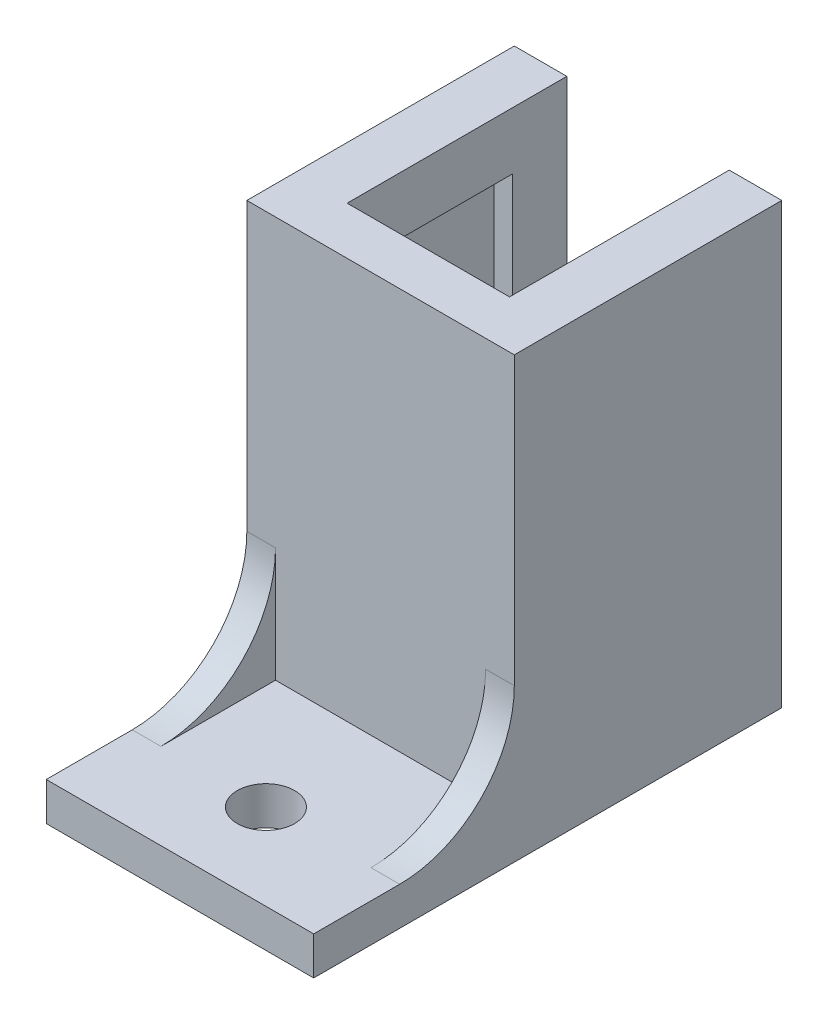
ISO-10303-21;
HEADER;
FILE_DESCRIPTION(('STEP AP214'),'2;1');
FILE_NAME('part.step','',(''),(''),'','','');
FILE_SCHEMA(('AUTOMOTIVE_DESIGN { 1 0 10303 214 1 1 1 1 }'));
ENDSEC;
DATA;
#1=APPLICATION_CONTEXT('core data for automotive mechanical design processes');
#2=APPLICATION_PROTOCOL_DEFINITION('international standard','automotive_design',2000,#1);
#3=PRODUCT_CONTEXT('',#1,'mechanical');
#4=PRODUCT('Part','Part','',(#3));
#5=PRODUCT_RELATED_PRODUCT_CATEGORY('part','',(#4));
#6=PRODUCT_DEFINITION_FORMATION('','',#4);
#7=PRODUCT_DEFINITION_CONTEXT('part definition',#1,'design');
#8=PRODUCT_DEFINITION('design','',#6,#7);
#9=PRODUCT_DEFINITION_SHAPE('','',#8);
#10=(LENGTH_UNIT() NAMED_UNIT(*) SI_UNIT(.MILLI.,.METRE.));
#11=(NAMED_UNIT(*) PLANE_ANGLE_UNIT() SI_UNIT($,.RADIAN.));
#12=(NAMED_UNIT(*) SI_UNIT($,.STERADIAN.) SOLID_ANGLE_UNIT());
#13=UNCERTAINTY_MEASURE_WITH_UNIT(LENGTH_MEASURE(1.E-05),#10,'distance_accuracy_value','');
#14=(GEOMETRIC_REPRESENTATION_CONTEXT(3) GLOBAL_UNCERTAINTY_ASSIGNED_CONTEXT((#13)) GLOBAL_UNIT_ASSIGNED_CONTEXT((#10,
#11,#12)) REPRESENTATION_CONTEXT('',''));
#15=CARTESIAN_POINT('',(0.,0.,0.));
#16=DIRECTION('',(0.,0.,1.));
#17=DIRECTION('',(1.,0.,0.));
#18=AXIS2_PLACEMENT_3D('',#15,#16,#17);
#19=CARTESIAN_POINT('',(0.,0.,0.));
#20=DIRECTION('',(0.,0.,1.));
#21=DIRECTION('',(1.,0.,0.));
#22=AXIS2_PLACEMENT_3D('',#19,#20,#21);
#23=PLANE('',#22);
#24=DIRECTION('',(0.,-1.,0.));
#25=VECTOR('',#24,1.);
#26=CARTESIAN_POINT('',(4.25,8.5,0.));
#27=LINE('',#26,#25);
#28=CARTESIAN_POINT('',(4.25,11.5,0.));
#29=VERTEX_POINT('',#28);
#30=CARTESIAN_POINT('',(4.25,-11.5,0.));
#31=VERTEX_POINT('',#30);
#32=EDGE_CURVE('E293',#29,#31,#27,.T.);
#33=ORIENTED_EDGE('',*,*,#32,.F.);
#34=DIRECTION('',(-1.,0.,0.));
#35=VECTOR('',#34,1.);
#36=CARTESIAN_POINT('',(0.,11.5,0.));
#37=LINE('',#36,#35);
#38=CARTESIAN_POINT('',(7.,11.5,0.));
#39=VERTEX_POINT('',#38);
#40=EDGE_CURVE('E192',#39,#29,#37,.T.);
#41=ORIENTED_EDGE('',*,*,#40,.F.);
#42=DIRECTION('',(0.,-1.,0.));
#43=VECTOR('',#42,1.);
#44=CARTESIAN_POINT('',(7.,0.,0.));
#45=LINE('',#44,#43);
#46=CARTESIAN_POINT('',(7.,-11.5,0.));
#47=VERTEX_POINT('',#46);
#48=EDGE_CURVE('E305',#39,#47,#45,.T.);
#49=ORIENTED_EDGE('',*,*,#48,.T.);
#50=DIRECTION('',(-1.,0.,0.));
#51=VECTOR('',#50,1.);
#52=CARTESIAN_POINT('',(0.,-11.5,0.));
#53=LINE('',#52,#51);
#54=EDGE_CURVE('E316',#47,#31,#53,.T.);
#55=ORIENTED_EDGE('',*,*,#54,.T.);
#56=EDGE_LOOP('',(#33,#41,#49,#55));
#57=FACE_BOUND('',#56,.T.);
#58=ADVANCED_FACE('F36',(#57),#23,.F.);
#59=CARTESIAN_POINT('',(0.,8.5,0.));
#60=DIRECTION('',(0.,-1.,0.));
#61=DIRECTION('',(1.,0.,0.));
#62=AXIS2_PLACEMENT_3D('',#59,#60,#61);
#63=PLANE('',#62);
#64=DIRECTION('',(0.,0.,1.));
#65=VECTOR('',#64,1.);
#66=CARTESIAN_POINT('',(4.25,8.5,0.));
#67=LINE('',#66,#65);
#68=CARTESIAN_POINT('',(4.25,8.5,2.85));
#69=VERTEX_POINT('',#68);
#70=CARTESIAN_POINT('',(4.25,8.5,11.5));
#71=VERTEX_POINT('',#70);
#72=EDGE_CURVE('E11',#69,#71,#67,.T.);
#73=ORIENTED_EDGE('',*,*,#72,.F.);
#74=DIRECTION('',(-1.,0.,0.));
#75=VECTOR('',#74,1.);
#76=CARTESIAN_POINT('',(0.,8.5,2.85));
#77=LINE('',#76,#75);
#78=CARTESIAN_POINT('',(5.2,8.5,2.85));
#79=VERTEX_POINT('',#78);
#80=EDGE_CURVE('E261',#79,#69,#77,.T.);
#81=ORIENTED_EDGE('',*,*,#80,.F.);
#82=DIRECTION('',(0.,0.,1.));
#83=VECTOR('',#82,1.);
#84=CARTESIAN_POINT('',(5.2,8.5,0.));
#85=LINE('',#84,#83);
#86=CARTESIAN_POINT('',(5.2,8.5,11.5));
#87=VERTEX_POINT('',#86);
#88=EDGE_CURVE('E262',#79,#87,#85,.T.);
#89=ORIENTED_EDGE('',*,*,#88,.T.);
#90=DIRECTION('',(-1.,0.,0.));
#91=VECTOR('',#90,1.);
#92=CARTESIAN_POINT('',(0.,8.5,11.5));
#93=LINE('',#92,#91);
#94=EDGE_CURVE('E266',#87,#71,#93,.T.);
#95=ORIENTED_EDGE('',*,*,#94,.T.);
#96=EDGE_LOOP('',(#73,#81,#89,#95));
#97=FACE_BOUND('',#96,.T.);
#98=ADVANCED_FACE('F371',(#97),#63,.T.);
#99=CARTESIAN_POINT('',(0.,0.,14.));
#100=DIRECTION('',(0.,0.,1.));
#101=DIRECTION('',(1.,0.,0.));
#102=AXIS2_PLACEMENT_3D('',#99,#100,#101);
#103=PLANE('',#102);
#104=DIRECTION('',(0.,-1.,0.));
#105=VECTOR('',#104,1.);
#106=CARTESIAN_POINT('',(5.5,-3.5,14.));
#107=LINE('',#106,#105);
#108=CARTESIAN_POINT('',(5.5,-3.5,14.));
#109=VERTEX_POINT('',#108);
#110=CARTESIAN_POINT('',(5.5,-9.5,14.));
#111=VERTEX_POINT('',#110);
#112=EDGE_CURVE('E203',#109,#111,#107,.T.);
#113=ORIENTED_EDGE('',*,*,#112,.F.);
#114=DIRECTION('',(1.,0.,0.));
#115=VECTOR('',#114,1.);
#116=CARTESIAN_POINT('',(5.5,-3.5,14.));
#117=LINE('',#116,#115);
#118=CARTESIAN_POINT('',(7.,-3.5,14.));
#119=VERTEX_POINT('',#118);
#120=EDGE_CURVE('E207',#109,#119,#117,.T.);
#121=ORIENTED_EDGE('',*,*,#120,.T.);
#122=DIRECTION('',(0.,-1.,0.));
#123=VECTOR('',#122,1.);
#124=CARTESIAN_POINT('',(7.,0.,14.));
#125=LINE('',#124,#123);
#126=CARTESIAN_POINT('',(7.,11.5,14.));
#127=VERTEX_POINT('',#126);
#128=EDGE_CURVE('E308',#127,#119,#125,.T.);
#129=ORIENTED_EDGE('',*,*,#128,.F.);
#130=DIRECTION('',(-1.,0.,0.));
#131=VECTOR('',#130,1.);
#132=CARTESIAN_POINT('',(0.,11.5,14.));
#133=LINE('',#132,#131);
#134=CARTESIAN_POINT('',(-7.,11.5,14.));
#135=VERTEX_POINT('',#134);
#136=EDGE_CURVE('E301',#127,#135,#133,.T.);
#137=ORIENTED_EDGE('',*,*,#136,.T.);
#138=DIRECTION('',(0.,-1.,0.));
#139=VECTOR('',#138,1.);
#140=CARTESIAN_POINT('',(-7.,0.,14.));
#141=LINE('',#140,#139);
#142=CARTESIAN_POINT('',(-7.,-3.5,14.));
#143=VERTEX_POINT('',#142);
#144=EDGE_CURVE('E304',#135,#143,#141,.T.);
#145=ORIENTED_EDGE('',*,*,#144,.T.);
#146=DIRECTION('',(-1.,0.,0.));
#147=VECTOR('',#146,1.);
#148=CARTESIAN_POINT('',(-5.5,-3.5,14.));
#149=LINE('',#148,#147);
#150=CARTESIAN_POINT('',(-5.5,-3.5,14.));
#151=VERTEX_POINT('',#150);
#152=EDGE_CURVE('E221',#151,#143,#149,.T.);
#153=ORIENTED_EDGE('',*,*,#152,.F.);
#154=DIRECTION('',(0.,-1.,0.));
#155=VECTOR('',#154,1.);
#156=CARTESIAN_POINT('',(-5.5,-3.5,14.));
#157=LINE('',#156,#155);
#158=CARTESIAN_POINT('',(-5.5,-9.5,14.));
#159=VERTEX_POINT('',#158);
#160=EDGE_CURVE('E215',#151,#159,#157,.T.);
#161=ORIENTED_EDGE('',*,*,#160,.T.);
#162=DIRECTION('',(1.,0.,0.));
#163=VECTOR('',#162,1.);
#164=CARTESIAN_POINT('',(7.,-9.5,14.));
#165=LINE('',#164,#163);
#166=EDGE_CURVE('E243',#159,#111,#165,.T.);
#167=ORIENTED_EDGE('',*,*,#166,.T.);
#168=EDGE_LOOP('',(#113,#121,#129,#137,#145,#153,#161,#167));
#169=FACE_BOUND('',#168,.T.);
#170=ADVANCED_FACE('F356',(#169),#103,.T.);
#171=CARTESIAN_POINT('',(0.,-9.5,0.));
#172=DIRECTION('',(0.,-1.,0.));
#173=DIRECTION('',(1.,0.,0.));
#174=AXIS2_PLACEMENT_3D('',#171,#172,#173);
#175=PLANE('',#174);
#176=CARTESIAN_POINT('',(0.,-9.5,20.));
#177=DIRECTION('',(0.,-1.,0.));
#178=DIRECTION('',(1.,0.,0.));
#179=AXIS2_PLACEMENT_3D('',#176,#177,#178);
#180=CIRCLE('',#179,1.5);
#181=CARTESIAN_POINT('',(1.5,-9.5,20.));
#182=VERTEX_POINT('',#181);
#183=EDGE_CURVE('E229',#182,#182,#180,.T.);
#184=ORIENTED_EDGE('',*,*,#183,.T.);
#185=EDGE_LOOP('',(#184));
#186=FACE_BOUND('',#185,.T.);
#187=DIRECTION('',(1.,0.,0.));
#188=VECTOR('',#187,1.);
#189=CARTESIAN_POINT('',(5.5,-9.5,20.));
#190=LINE('',#189,#188);
#191=CARTESIAN_POINT('',(5.5,-9.5,20.));
#192=VERTEX_POINT('',#191);
#193=CARTESIAN_POINT('',(7.,-9.5,20.));
#194=VERTEX_POINT('',#193);
#195=EDGE_CURVE('E205',#192,#194,#190,.T.);
#196=ORIENTED_EDGE('',*,*,#195,.F.);
#197=DIRECTION('',(0.,0.,1.));
#198=VECTOR('',#197,1.);
#199=CARTESIAN_POINT('',(5.5,-9.5,14.));
#200=LINE('',#199,#198);
#201=EDGE_CURVE('E201',#111,#192,#200,.T.);
#202=ORIENTED_EDGE('',*,*,#201,.F.);
#203=ORIENTED_EDGE('',*,*,#166,.F.);
#204=DIRECTION('',(0.,0.,1.));
#205=VECTOR('',#204,1.);
#206=CARTESIAN_POINT('',(-5.5,-9.5,14.));
#207=LINE('',#206,#205);
#208=CARTESIAN_POINT('',(-5.5,-9.5,20.));
#209=VERTEX_POINT('',#208);
#210=EDGE_CURVE('E218',#159,#209,#207,.T.);
#211=ORIENTED_EDGE('',*,*,#210,.T.);
#212=DIRECTION('',(-1.,0.,0.));
#213=VECTOR('',#212,1.);
#214=CARTESIAN_POINT('',(-5.5,-9.5,20.));
#215=LINE('',#214,#213);
#216=CARTESIAN_POINT('',(-7.,-9.5,20.));
#217=VERTEX_POINT('',#216);
#218=EDGE_CURVE('E224',#209,#217,#215,.T.);
#219=ORIENTED_EDGE('',*,*,#218,.T.);
#220=DIRECTION('',(0.,0.,-1.));
#221=VECTOR('',#220,1.);
#222=CARTESIAN_POINT('',(-7.,-9.5,14.));
#223=LINE('',#222,#221);
#224=CARTESIAN_POINT('',(-7.,-9.5,24.5));
#225=VERTEX_POINT('',#224);
#226=EDGE_CURVE('E240',#225,#217,#223,.T.);
#227=ORIENTED_EDGE('',*,*,#226,.F.);
#228=DIRECTION('',(-1.,0.,0.));
#229=VECTOR('',#228,1.);
#230=CARTESIAN_POINT('',(7.,-9.5,24.5));
#231=LINE('',#230,#229);
#232=CARTESIAN_POINT('',(7.,-9.5,24.5));
#233=VERTEX_POINT('',#232);
#234=EDGE_CURVE('E237',#233,#225,#231,.T.);
#235=ORIENTED_EDGE('',*,*,#234,.F.);
#236=DIRECTION('',(0.,0.,1.));
#237=VECTOR('',#236,1.);
#238=CARTESIAN_POINT('',(7.,-9.5,14.));
#239=LINE('',#238,#237);
#240=EDGE_CURVE('E235',#194,#233,#239,.T.);
#241=ORIENTED_EDGE('',*,*,#240,.F.);
#242=EDGE_LOOP('',(#196,#202,#203,#211,#219,#227,#235,#241));
#243=FACE_BOUND('',#242,.T.);
#244=ADVANCED_FACE('F351',(#186,#243),#175,.F.);
#245=CARTESIAN_POINT('',(0.,-11.5,14.));
#246=DIRECTION('',(0.,-1.,0.));
#247=DIRECTION('',(1.,0.,0.));
#248=AXIS2_PLACEMENT_3D('',#245,#246,#247);
#249=PLANE('',#248);
#250=DIRECTION('',(-1.,0.,0.));
#251=VECTOR('',#250,1.);
#252=CARTESIAN_POINT('',(0.,-11.5,2.85));
#253=LINE('',#252,#251);
#254=CARTESIAN_POINT('',(5.2,-11.5,2.85));
#255=VERTEX_POINT('',#254);
#256=CARTESIAN_POINT('',(4.25,-11.5,2.85));
#257=VERTEX_POINT('',#256);
#258=EDGE_CURVE('E275',#255,#257,#253,.T.);
#259=ORIENTED_EDGE('',*,*,#258,.T.);
#260=DIRECTION('',(0.,0.,-1.));
#261=VECTOR('',#260,1.);
#262=CARTESIAN_POINT('',(4.25,-11.5,0.));
#263=LINE('',#262,#261);
#264=EDGE_CURVE('E277',#257,#31,#263,.T.);
#265=ORIENTED_EDGE('',*,*,#264,.T.);
#266=ORIENTED_EDGE('',*,*,#54,.F.);
#267=DIRECTION('',(0.,0.,-1.));
#268=VECTOR('',#267,1.);
#269=CARTESIAN_POINT('',(7.,-11.5,14.));
#270=LINE('',#269,#268);
#271=CARTESIAN_POINT('',(7.,-11.5,24.5));
#272=VERTEX_POINT('',#271);
#273=EDGE_CURVE('E322',#272,#47,#270,.T.);
#274=ORIENTED_EDGE('',*,*,#273,.F.);
#275=DIRECTION('',(-1.,0.,0.));
#276=VECTOR('',#275,1.);
#277=CARTESIAN_POINT('',(7.,-11.5,24.5));
#278=LINE('',#277,#276);
#279=CARTESIAN_POINT('',(-7.,-11.5,24.5));
#280=VERTEX_POINT('',#279);
#281=EDGE_CURVE('E232',#272,#280,#278,.T.);
#282=ORIENTED_EDGE('',*,*,#281,.T.);
#283=DIRECTION('',(0.,0.,-1.));
#284=VECTOR('',#283,1.);
#285=CARTESIAN_POINT('',(-7.,-11.5,14.));
#286=LINE('',#285,#284);
#287=CARTESIAN_POINT('',(-7.,-11.5,0.));
#288=VERTEX_POINT('',#287);
#289=EDGE_CURVE('E324',#280,#288,#286,.T.);
#290=ORIENTED_EDGE('',*,*,#289,.T.);
#291=CARTESIAN_POINT('',(-4.25,-11.5,0.));
#292=VERTEX_POINT('',#291);
#293=EDGE_CURVE('E315',#292,#288,#53,.T.);
#294=ORIENTED_EDGE('',*,*,#293,.F.);
#295=DIRECTION('',(0.,0.,-1.));
#296=VECTOR('',#295,1.);
#297=CARTESIAN_POINT('',(-4.25,-11.5,0.));
#298=LINE('',#297,#296);
#299=CARTESIAN_POINT('',(-4.25,-11.5,2.85));
#300=VERTEX_POINT('',#299);
#301=EDGE_CURVE('E274',#300,#292,#298,.T.);
#302=ORIENTED_EDGE('',*,*,#301,.F.);
#303=CARTESIAN_POINT('',(-5.2,-11.5,2.85));
#304=VERTEX_POINT('',#303);
#305=EDGE_CURVE('E271',#300,#304,#253,.T.);
#306=ORIENTED_EDGE('',*,*,#305,.T.);
#307=DIRECTION('',(0.,0.,1.));
#308=VECTOR('',#307,1.);
#309=CARTESIAN_POINT('',(-5.2,-11.5,0.));
#310=LINE('',#309,#308);
#311=CARTESIAN_POINT('',(-5.2,-11.5,11.5));
#312=VERTEX_POINT('',#311);
#313=EDGE_CURVE('E252',#304,#312,#310,.T.);
#314=ORIENTED_EDGE('',*,*,#313,.T.);
#315=DIRECTION('',(-1.,0.,0.));
#316=VECTOR('',#315,1.);
#317=CARTESIAN_POINT('',(0.,-11.5,11.5));
#318=LINE('',#317,#316);
#319=CARTESIAN_POINT('',(5.2,-11.5,11.5));
#320=VERTEX_POINT('',#319);
#321=EDGE_CURVE('E259',#320,#312,#318,.T.);
#322=ORIENTED_EDGE('',*,*,#321,.F.);
#323=DIRECTION('',(0.,0.,1.));
#324=VECTOR('',#323,1.);
#325=CARTESIAN_POINT('',(5.2,-11.5,0.));
#326=LINE('',#325,#324);
#327=EDGE_CURVE('E280',#255,#320,#326,.T.);
#328=ORIENTED_EDGE('',*,*,#327,.F.);
#329=EDGE_LOOP('',(#259,#265,#266,#274,#282,#290,#294,#302,#306,#314,#322,#328));
#330=FACE_BOUND('',#329,.T.);
#331=CARTESIAN_POINT('',(0.,-11.5,20.));
#332=DIRECTION('',(0.,-1.,0.));
#333=DIRECTION('',(1.,0.,0.));
#334=AXIS2_PLACEMENT_3D('',#331,#332,#333);
#335=CIRCLE('',#334,1.5);
#336=CARTESIAN_POINT('',(1.5,-11.5,20.));
#337=VERTEX_POINT('',#336);
#338=EDGE_CURVE('E227',#337,#337,#335,.T.);
#339=ORIENTED_EDGE('',*,*,#338,.F.);
#340=EDGE_LOOP('',(#339));
#341=FACE_BOUND('',#340,.T.);
#342=ADVANCED_FACE('F340',(#330,#341),#249,.T.);
#343=CARTESIAN_POINT('',(-4.25,11.5,0.));
#344=VERTEX_POINT('',#343);
#345=CARTESIAN_POINT('',(-7.,11.5,0.));
#346=VERTEX_POINT('',#345);
#347=EDGE_CURVE('E286',#344,#346,#37,.T.);
#348=ORIENTED_EDGE('',*,*,#347,.F.);
#349=DIRECTION('',(0.,-1.,0.));
#350=VECTOR('',#349,1.);
#351=CARTESIAN_POINT('',(-4.25,8.5,0.));
#352=LINE('',#351,#350);
#353=EDGE_CURVE('E295',#344,#292,#352,.T.);
#354=ORIENTED_EDGE('',*,*,#353,.T.);
#355=ORIENTED_EDGE('',*,*,#293,.T.);
#356=DIRECTION('',(0.,-1.,0.));
#357=VECTOR('',#356,1.);
#358=CARTESIAN_POINT('',(-7.,0.,0.));
#359=LINE('',#358,#357);
#360=EDGE_CURVE('E312',#346,#288,#359,.T.);
#361=ORIENTED_EDGE('',*,*,#360,.F.);
#362=EDGE_LOOP('',(#348,#354,#355,#361));
#363=FACE_BOUND('',#362,.T.);
#364=ADVANCED_FACE('F335',(#363),#23,.F.);
#365=CARTESIAN_POINT('',(0.,11.5,14.));
#366=DIRECTION('',(0.,-1.,0.));
#367=DIRECTION('',(1.,0.,0.));
#368=AXIS2_PLACEMENT_3D('',#365,#366,#367);
#369=PLANE('',#368);
#370=ORIENTED_EDGE('',*,*,#40,.T.);
#371=DIRECTION('',(0.,0.,1.));
#372=VECTOR('',#371,1.);
#373=CARTESIAN_POINT('',(4.25,11.5,0.));
#374=LINE('',#373,#372);
#375=CARTESIAN_POINT('',(4.25,11.5,11.5));
#376=VERTEX_POINT('',#375);
#377=EDGE_CURVE('E175',#29,#376,#374,.T.);
#378=ORIENTED_EDGE('',*,*,#377,.T.);
#379=DIRECTION('',(-1.,0.,0.));
#380=VECTOR('',#379,1.);
#381=CARTESIAN_POINT('',(4.25,11.5,11.5));
#382=LINE('',#381,#380);
#383=CARTESIAN_POINT('',(-4.25,11.5,11.5));
#384=VERTEX_POINT('',#383);
#385=EDGE_CURVE('E183',#376,#384,#382,.T.);
#386=ORIENTED_EDGE('',*,*,#385,.T.);
#387=DIRECTION('',(0.,0.,-1.));
#388=VECTOR('',#387,1.);
#389=CARTESIAN_POINT('',(-4.25,11.5,0.));
#390=LINE('',#389,#388);
#391=EDGE_CURVE('E180',#384,#344,#390,.T.);
#392=ORIENTED_EDGE('',*,*,#391,.T.);
#393=ORIENTED_EDGE('',*,*,#347,.T.);
#394=DIRECTION('',(0.,0.,-1.));
#395=VECTOR('',#394,1.);
#396=CARTESIAN_POINT('',(-7.,11.5,14.));
#397=LINE('',#396,#395);
#398=EDGE_CURVE('E44',#135,#346,#397,.T.);
#399=ORIENTED_EDGE('',*,*,#398,.F.);
#400=ORIENTED_EDGE('',*,*,#136,.F.);
#401=DIRECTION('',(0.,0.,-1.));
#402=VECTOR('',#401,1.);
#403=CARTESIAN_POINT('',(7.,11.5,14.));
#404=LINE('',#403,#402);
#405=EDGE_CURVE('E310',#127,#39,#404,.T.);
#406=ORIENTED_EDGE('',*,*,#405,.T.);
#407=EDGE_LOOP('',(#370,#378,#386,#392,#393,#399,#400,#406));
#408=FACE_BOUND('',#407,.T.);
#409=ADVANCED_FACE('F38',(#408),#369,.F.);
#410=CARTESIAN_POINT('',(-7.,0.,14.));
#411=DIRECTION('',(1.,0.,0.));
#412=DIRECTION('',(0.,1.,0.));
#413=AXIS2_PLACEMENT_3D('',#410,#411,#412);
#414=PLANE('',#413);
#415=ORIENTED_EDGE('',*,*,#360,.T.);
#416=ORIENTED_EDGE('',*,*,#289,.F.);
#417=DIRECTION('',(0.,-1.,0.));
#418=VECTOR('',#417,1.);
#419=CARTESIAN_POINT('',(-7.,-9.5,24.5));
#420=LINE('',#419,#418);
#421=EDGE_CURVE('E249',#225,#280,#420,.T.);
#422=ORIENTED_EDGE('',*,*,#421,.F.);
#423=ORIENTED_EDGE('',*,*,#226,.T.);
#424=CARTESIAN_POINT('',(-7.,-3.5,20.));
#425=DIRECTION('',(1.,0.,0.));
#426=DIRECTION('',(0.,1.,0.));
#427=AXIS2_PLACEMENT_3D('',#424,#425,#426);
#428=CIRCLE('',#427,6.);
#429=EDGE_CURVE('E210',#217,#143,#428,.T.);
#430=ORIENTED_EDGE('',*,*,#429,.T.);
#431=ORIENTED_EDGE('',*,*,#144,.F.);
#432=ORIENTED_EDGE('',*,*,#398,.T.);
#433=EDGE_LOOP('',(#415,#416,#422,#423,#430,#431,#432));
#434=FACE_BOUND('',#433,.T.);
#435=ADVANCED_FACE('F329',(#434),#414,.F.);
#436=CARTESIAN_POINT('',(7.,0.,14.));
#437=DIRECTION('',(1.,0.,0.));
#438=DIRECTION('',(0.,1.,0.));
#439=AXIS2_PLACEMENT_3D('',#436,#437,#438);
#440=PLANE('',#439);
#441=ORIENTED_EDGE('',*,*,#48,.F.);
#442=ORIENTED_EDGE('',*,*,#405,.F.);
#443=ORIENTED_EDGE('',*,*,#128,.T.);
#444=CARTESIAN_POINT('',(7.,-3.5,20.));
#445=DIRECTION('',(1.,0.,0.));
#446=DIRECTION('',(0.,1.,0.));
#447=AXIS2_PLACEMENT_3D('',#444,#445,#446);
#448=CIRCLE('',#447,6.);
#449=EDGE_CURVE('E58',#194,#119,#448,.T.);
#450=ORIENTED_EDGE('',*,*,#449,.F.);
#451=ORIENTED_EDGE('',*,*,#240,.T.);
#452=DIRECTION('',(0.,-1.,0.));
#453=VECTOR('',#452,1.);
#454=CARTESIAN_POINT('',(7.,-9.5,24.5));
#455=LINE('',#454,#453);
#456=EDGE_CURVE('E246',#233,#272,#455,.T.);
#457=ORIENTED_EDGE('',*,*,#456,.T.);
#458=ORIENTED_EDGE('',*,*,#273,.T.);
#459=EDGE_LOOP('',(#441,#442,#443,#450,#451,#457,#458));
#460=FACE_BOUND('',#459,.T.);
#461=ADVANCED_FACE('F359',(#460),#440,.T.);
#462=CARTESIAN_POINT('',(-5.2,8.5,0.));
#463=DIRECTION('',(1.,0.,0.));
#464=DIRECTION('',(0.,1.,0.));
#465=AXIS2_PLACEMENT_3D('',#462,#463,#464);
#466=PLANE('',#465);
#467=ORIENTED_EDGE('',*,*,#313,.F.);
#468=DIRECTION('',(0.,-1.,0.));
#469=VECTOR('',#468,1.);
#470=CARTESIAN_POINT('',(-5.2,8.5,2.85));
#471=LINE('',#470,#469);
#472=CARTESIAN_POINT('',(-5.2,8.5,2.85));
#473=VERTEX_POINT('',#472);
#474=EDGE_CURVE('E268',#473,#304,#471,.T.);
#475=ORIENTED_EDGE('',*,*,#474,.F.);
#476=DIRECTION('',(0.,0.,1.));
#477=VECTOR('',#476,1.);
#478=CARTESIAN_POINT('',(-5.2,8.5,0.));
#479=LINE('',#478,#477);
#480=CARTESIAN_POINT('',(-5.2,8.5,11.5));
#481=VERTEX_POINT('',#480);
#482=EDGE_CURVE('E255',#473,#481,#479,.T.);
#483=ORIENTED_EDGE('',*,*,#482,.T.);
#484=DIRECTION('',(0.,-1.,0.));
#485=VECTOR('',#484,1.);
#486=CARTESIAN_POINT('',(-5.2,8.5,11.5));
#487=LINE('',#486,#485);
#488=EDGE_CURVE('E284',#481,#312,#487,.T.);
#489=ORIENTED_EDGE('',*,*,#488,.T.);
#490=EDGE_LOOP('',(#467,#475,#483,#489));
#491=FACE_BOUND('',#490,.T.);
#492=ADVANCED_FACE('F379',(#491),#466,.T.);
#493=CARTESIAN_POINT('',(0.,8.5,11.5));
#494=DIRECTION('',(0.,0.,1.));
#495=DIRECTION('',(1.,0.,0.));
#496=AXIS2_PLACEMENT_3D('',#493,#494,#495);
#497=PLANE('',#496);
#498=ORIENTED_EDGE('',*,*,#321,.T.);
#499=ORIENTED_EDGE('',*,*,#488,.F.);
#500=CARTESIAN_POINT('',(-4.25,8.5,11.5));
#501=VERTEX_POINT('',#500);
#502=EDGE_CURVE('E265',#501,#481,#93,.T.);
#503=ORIENTED_EDGE('',*,*,#502,.F.);
#504=DIRECTION('',(0.,-1.,0.));
#505=VECTOR('',#504,1.);
#506=CARTESIAN_POINT('',(-4.25,11.5,11.5));
#507=LINE('',#506,#505);
#508=EDGE_CURVE('E179',#384,#501,#507,.T.);
#509=ORIENTED_EDGE('',*,*,#508,.F.);
#510=ORIENTED_EDGE('',*,*,#385,.F.);
#511=DIRECTION('',(0.,-1.,0.));
#512=VECTOR('',#511,1.);
#513=CARTESIAN_POINT('',(4.25,11.5,11.5));
#514=LINE('',#513,#512);
#515=EDGE_CURVE('E51',#376,#71,#514,.T.);
#516=ORIENTED_EDGE('',*,*,#515,.T.);
#517=ORIENTED_EDGE('',*,*,#94,.F.);
#518=DIRECTION('',(0.,-1.,0.));
#519=VECTOR('',#518,1.);
#520=CARTESIAN_POINT('',(5.2,8.5,11.5));
#521=LINE('',#520,#519);
#522=EDGE_CURVE('E287',#87,#320,#521,.T.);
#523=ORIENTED_EDGE('',*,*,#522,.T.);
#524=EDGE_LOOP('',(#498,#499,#503,#509,#510,#516,#517,#523));
#525=FACE_BOUND('',#524,.T.);
#526=ADVANCED_FACE('F185',(#525),#497,.F.);
#527=CARTESIAN_POINT('',(5.2,8.5,0.));
#528=DIRECTION('',(1.,0.,0.));
#529=DIRECTION('',(0.,1.,0.));
#530=AXIS2_PLACEMENT_3D('',#527,#528,#529);
#531=PLANE('',#530);
#532=ORIENTED_EDGE('',*,*,#327,.T.);
#533=ORIENTED_EDGE('',*,*,#522,.F.);
#534=ORIENTED_EDGE('',*,*,#88,.F.);
#535=DIRECTION('',(0.,-1.,0.));
#536=VECTOR('',#535,1.);
#537=CARTESIAN_POINT('',(5.2,8.5,2.85));
#538=LINE('',#537,#536);
#539=EDGE_CURVE('E289',#79,#255,#538,.T.);
#540=ORIENTED_EDGE('',*,*,#539,.T.);
#541=EDGE_LOOP('',(#532,#533,#534,#540));
#542=FACE_BOUND('',#541,.T.);
#543=ADVANCED_FACE('F373',(#542),#531,.F.);
#544=CARTESIAN_POINT('',(0.,8.5,2.85));
#545=DIRECTION('',(0.,0.,1.));
#546=DIRECTION('',(1.,0.,0.));
#547=AXIS2_PLACEMENT_3D('',#544,#545,#546);
#548=PLANE('',#547);
#549=ORIENTED_EDGE('',*,*,#258,.F.);
#550=ORIENTED_EDGE('',*,*,#539,.F.);
#551=ORIENTED_EDGE('',*,*,#80,.T.);
#552=DIRECTION('',(0.,-1.,0.));
#553=VECTOR('',#552,1.);
#554=CARTESIAN_POINT('',(4.25,8.5,2.85));
#555=LINE('',#554,#553);
#556=EDGE_CURVE('E291',#69,#257,#555,.T.);
#557=ORIENTED_EDGE('',*,*,#556,.T.);
#558=EDGE_LOOP('',(#549,#550,#551,#557));
#559=FACE_BOUND('',#558,.T.);
#560=ADVANCED_FACE('F366',(#559),#548,.T.);
#561=CARTESIAN_POINT('',(4.25,8.5,0.));
#562=DIRECTION('',(-1.,0.,0.));
#563=DIRECTION('',(0.,0.,1.));
#564=AXIS2_PLACEMENT_3D('',#561,#562,#563);
#565=PLANE('',#564);
#566=ORIENTED_EDGE('',*,*,#264,.F.);
#567=ORIENTED_EDGE('',*,*,#556,.F.);
#568=ORIENTED_EDGE('',*,*,#72,.T.);
#569=ORIENTED_EDGE('',*,*,#515,.F.);
#570=ORIENTED_EDGE('',*,*,#377,.F.);
#571=ORIENTED_EDGE('',*,*,#32,.T.);
#572=EDGE_LOOP('',(#566,#567,#568,#569,#570,#571));
#573=FACE_BOUND('',#572,.T.);
#574=ADVANCED_FACE('F173',(#573),#565,.T.);
#575=CARTESIAN_POINT('',(-4.25,8.5,0.));
#576=DIRECTION('',(-1.,0.,0.));
#577=DIRECTION('',(0.,0.,1.));
#578=AXIS2_PLACEMENT_3D('',#575,#576,#577);
#579=PLANE('',#578);
#580=ORIENTED_EDGE('',*,*,#301,.T.);
#581=ORIENTED_EDGE('',*,*,#353,.F.);
#582=ORIENTED_EDGE('',*,*,#391,.F.);
#583=ORIENTED_EDGE('',*,*,#508,.T.);
#584=DIRECTION('',(0.,0.,-1.));
#585=VECTOR('',#584,1.);
#586=CARTESIAN_POINT('',(-4.25,8.5,0.));
#587=LINE('',#586,#585);
#588=CARTESIAN_POINT('',(-4.25,8.5,2.85));
#589=VERTEX_POINT('',#588);
#590=EDGE_CURVE('E193',#501,#589,#587,.T.);
#591=ORIENTED_EDGE('',*,*,#590,.T.);
#592=DIRECTION('',(0.,-1.,0.));
#593=VECTOR('',#592,1.);
#594=CARTESIAN_POINT('',(-4.25,8.5,2.85));
#595=LINE('',#594,#593);
#596=EDGE_CURVE('E298',#589,#300,#595,.T.);
#597=ORIENTED_EDGE('',*,*,#596,.T.);
#598=EDGE_LOOP('',(#580,#581,#582,#583,#591,#597));
#599=FACE_BOUND('',#598,.T.);
#600=ADVANCED_FACE('F387',(#599),#579,.F.);
#601=ORIENTED_EDGE('',*,*,#305,.F.);
#602=ORIENTED_EDGE('',*,*,#596,.F.);
#603=EDGE_CURVE('E258',#589,#473,#77,.T.);
#604=ORIENTED_EDGE('',*,*,#603,.T.);
#605=ORIENTED_EDGE('',*,*,#474,.T.);
#606=EDGE_LOOP('',(#601,#602,#604,#605));
#607=FACE_BOUND('',#606,.T.);
#608=ADVANCED_FACE('F389',(#607),#548,.T.);
#609=ORIENTED_EDGE('',*,*,#590,.F.);
#610=ORIENTED_EDGE('',*,*,#502,.T.);
#611=ORIENTED_EDGE('',*,*,#482,.F.);
#612=ORIENTED_EDGE('',*,*,#603,.F.);
#613=EDGE_LOOP('',(#609,#610,#611,#612));
#614=FACE_BOUND('',#613,.T.);
#615=ADVANCED_FACE('F384',(#614),#63,.T.);
#616=CARTESIAN_POINT('',(7.,-9.5,24.5));
#617=DIRECTION('',(0.,0.,1.));
#618=DIRECTION('',(1.,0.,0.));
#619=AXIS2_PLACEMENT_3D('',#616,#617,#618);
#620=PLANE('',#619);
#621=ORIENTED_EDGE('',*,*,#281,.F.);
#622=ORIENTED_EDGE('',*,*,#456,.F.);
#623=ORIENTED_EDGE('',*,*,#234,.T.);
#624=ORIENTED_EDGE('',*,*,#421,.T.);
#625=EDGE_LOOP('',(#621,#622,#623,#624));
#626=FACE_BOUND('',#625,.T.);
#627=ADVANCED_FACE('F345',(#626),#620,.T.);
#628=CARTESIAN_POINT('',(0.,-9.5,20.));
#629=DIRECTION('',(0.,-1.,0.));
#630=DIRECTION('',(1.,0.,0.));
#631=AXIS2_PLACEMENT_3D('',#628,#629,#630);
#632=CYLINDRICAL_SURFACE('',#631,1.5);
#633=ORIENTED_EDGE('',*,*,#183,.F.);
#634=EDGE_LOOP('',(#633));
#635=FACE_BOUND('',#634,.T.);
#636=ORIENTED_EDGE('',*,*,#338,.T.);
#637=EDGE_LOOP('',(#636));
#638=FACE_BOUND('',#637,.T.);
#639=ADVANCED_FACE('F542',(#635,#638),#632,.F.);
#640=CARTESIAN_POINT('',(-5.5,-3.5,20.));
#641=DIRECTION('',(-1.,0.,0.));
#642=DIRECTION('',(0.,-1.,0.));
#643=AXIS2_PLACEMENT_3D('',#640,#641,#642);
#644=CYLINDRICAL_SURFACE('',#643,6.);
#645=ORIENTED_EDGE('',*,*,#429,.F.);
#646=ORIENTED_EDGE('',*,*,#218,.F.);
#647=CARTESIAN_POINT('',(-5.5,-3.5,20.));
#648=DIRECTION('',(1.,0.,0.));
#649=DIRECTION('',(0.,1.,0.));
#650=AXIS2_PLACEMENT_3D('',#647,#648,#649);
#651=CIRCLE('',#650,6.);
#652=EDGE_CURVE('E212',#209,#151,#651,.T.);
#653=ORIENTED_EDGE('',*,*,#652,.T.);
#654=ORIENTED_EDGE('',*,*,#152,.T.);
#655=EDGE_LOOP('',(#645,#646,#653,#654));
#656=FACE_BOUND('',#655,.T.);
#657=ADVANCED_FACE('F549',(#656),#644,.F.);
#658=CARTESIAN_POINT('',(-5.5,-3.5,20.));
#659=DIRECTION('',(1.,0.,0.));
#660=DIRECTION('',(0.,1.,0.));
#661=AXIS2_PLACEMENT_3D('',#658,#659,#660);
#662=PLANE('',#661);
#663=ORIENTED_EDGE('',*,*,#652,.F.);
#664=ORIENTED_EDGE('',*,*,#210,.F.);
#665=ORIENTED_EDGE('',*,*,#160,.F.);
#666=EDGE_LOOP('',(#663,#664,#665));
#667=FACE_BOUND('',#666,.T.);
#668=ADVANCED_FACE('F458',(#667),#662,.T.);
#669=CARTESIAN_POINT('',(5.5,-3.5,20.));
#670=DIRECTION('',(1.,0.,0.));
#671=DIRECTION('',(0.,1.,0.));
#672=AXIS2_PLACEMENT_3D('',#669,#670,#671);
#673=CYLINDRICAL_SURFACE('',#672,6.);
#674=ORIENTED_EDGE('',*,*,#449,.T.);
#675=ORIENTED_EDGE('',*,*,#120,.F.);
#676=CARTESIAN_POINT('',(5.5,-3.5,20.));
#677=DIRECTION('',(1.,0.,0.));
#678=DIRECTION('',(0.,1.,0.));
#679=AXIS2_PLACEMENT_3D('',#676,#677,#678);
#680=CIRCLE('',#679,6.);
#681=EDGE_CURVE('E199',#192,#109,#680,.T.);
#682=ORIENTED_EDGE('',*,*,#681,.F.);
#683=ORIENTED_EDGE('',*,*,#195,.T.);
#684=EDGE_LOOP('',(#674,#675,#682,#683));
#685=FACE_BOUND('',#684,.T.);
#686=ADVANCED_FACE('F453',(#685),#673,.F.);
#687=CARTESIAN_POINT('',(5.5,-3.5,20.));
#688=DIRECTION('',(-1.,0.,0.));
#689=DIRECTION('',(0.,1.,0.));
#690=AXIS2_PLACEMENT_3D('',#687,#688,#689);
#691=PLANE('',#690);
#692=ORIENTED_EDGE('',*,*,#681,.T.);
#693=ORIENTED_EDGE('',*,*,#112,.T.);
#694=ORIENTED_EDGE('',*,*,#201,.T.);
#695=EDGE_LOOP('',(#692,#693,#694));
#696=FACE_BOUND('',#695,.T.);
#697=ADVANCED_FACE('F457',(#696),#691,.T.);
#698=CLOSED_SHELL('',(#58,#98,#170,#244,#342,#364,#409,#435,#461,#492,#526,#543,#560,#574,#600,
#608,#615,#627,#639,#657,#668,#686,#697));
#699=MANIFOLD_SOLID_BREP('B2',#698);
#700=ADVANCED_BREP_SHAPE_REPRESENTATION('',(#18,#699),#14);
#701=SHAPE_DEFINITION_REPRESENTATION(#9,#700);
ENDSEC;
END-ISO-10303-21;
